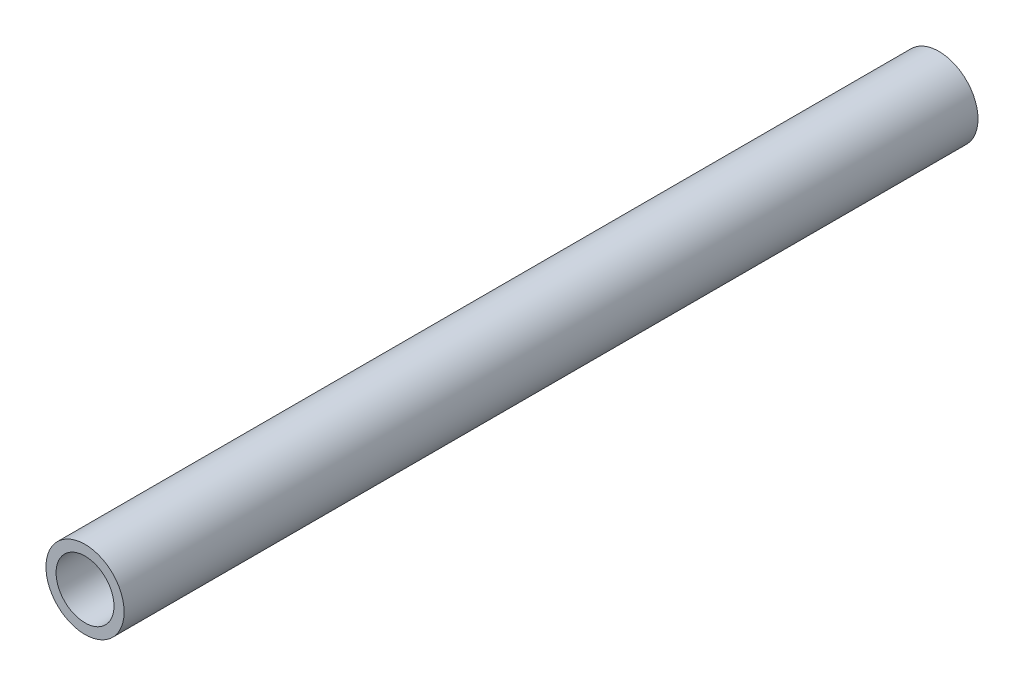
ISO-10303-21;
HEADER;
FILE_DESCRIPTION(('STEP AP214'),'2;1');
FILE_NAME('part.step','',(''),(''),'','','');
FILE_SCHEMA(('AUTOMOTIVE_DESIGN { 1 0 10303 214 1 1 1 1 }'));
ENDSEC;
DATA;
#1=APPLICATION_CONTEXT('core data for automotive mechanical design processes');
#2=APPLICATION_PROTOCOL_DEFINITION('international standard','automotive_design',2000,#1);
#3=PRODUCT_CONTEXT('',#1,'mechanical');
#4=PRODUCT('Part','Part','',(#3));
#5=PRODUCT_RELATED_PRODUCT_CATEGORY('part','',(#4));
#6=PRODUCT_DEFINITION_FORMATION('','',#4);
#7=PRODUCT_DEFINITION_CONTEXT('part definition',#1,'design');
#8=PRODUCT_DEFINITION('design','',#6,#7);
#9=PRODUCT_DEFINITION_SHAPE('','',#8);
#10=(LENGTH_UNIT() NAMED_UNIT(*) SI_UNIT(.MILLI.,.METRE.));
#11=(NAMED_UNIT(*) PLANE_ANGLE_UNIT() SI_UNIT($,.RADIAN.));
#12=(NAMED_UNIT(*) SI_UNIT($,.STERADIAN.) SOLID_ANGLE_UNIT());
#13=UNCERTAINTY_MEASURE_WITH_UNIT(LENGTH_MEASURE(1.E-05),#10,'distance_accuracy_value','');
#14=(GEOMETRIC_REPRESENTATION_CONTEXT(3) GLOBAL_UNCERTAINTY_ASSIGNED_CONTEXT((#13)) GLOBAL_UNIT_ASSIGNED_CONTEXT((#10,
#11,#12)) REPRESENTATION_CONTEXT('',''));
#15=CARTESIAN_POINT('',(0.,0.,0.));
#16=DIRECTION('',(0.,0.,1.));
#17=DIRECTION('',(1.,0.,0.));
#18=AXIS2_PLACEMENT_3D('',#15,#16,#17);
#19=CARTESIAN_POINT('',(0.,0.,-91.5));
#20=DIRECTION('',(0.,0.,1.));
#21=DIRECTION('',(1.,0.,0.));
#22=AXIS2_PLACEMENT_3D('',#19,#20,#21);
#23=CYLINDRICAL_SURFACE('',#22,10.668);
#24=CARTESIAN_POINT('',(0.,0.,-91.5));
#25=DIRECTION('',(0.,0.,1.));
#26=DIRECTION('',(1.,0.,0.));
#27=AXIS2_PLACEMENT_3D('',#24,#25,#26);
#28=CIRCLE('',#27,10.668);
#29=CARTESIAN_POINT('',(10.668,0.,-91.5));
#30=VERTEX_POINT('',#29);
#31=EDGE_CURVE('E11',#30,#30,#28,.T.);
#32=ORIENTED_EDGE('',*,*,#31,.T.);
#33=EDGE_LOOP('',(#32));
#34=FACE_BOUND('',#33,.T.);
#35=CARTESIAN_POINT('',(0.,0.,141.5));
#36=DIRECTION('',(0.,0.,1.));
#37=DIRECTION('',(1.,0.,0.));
#38=AXIS2_PLACEMENT_3D('',#35,#36,#37);
#39=CIRCLE('',#38,10.668);
#40=CARTESIAN_POINT('',(10.668,0.,141.5));
#41=VERTEX_POINT('',#40);
#42=EDGE_CURVE('E53',#41,#41,#39,.T.);
#43=ORIENTED_EDGE('',*,*,#42,.F.);
#44=EDGE_LOOP('',(#43));
#45=FACE_BOUND('',#44,.T.);
#46=ADVANCED_FACE('F43',(#34,#45),#23,.T.);
#47=CARTESIAN_POINT('',(0.,0.,-91.5));
#48=DIRECTION('',(0.,0.,1.));
#49=DIRECTION('',(1.,0.,0.));
#50=AXIS2_PLACEMENT_3D('',#47,#48,#49);
#51=PLANE('',#50);
#52=CARTESIAN_POINT('',(0.,0.,-91.5));
#53=DIRECTION('',(0.,0.,1.));
#54=DIRECTION('',(1.,0.,0.));
#55=AXIS2_PLACEMENT_3D('',#52,#53,#54);
#56=CIRCLE('',#55,7.8994);
#57=CARTESIAN_POINT('',(7.8994,0.,-91.5));
#58=VERTEX_POINT('',#57);
#59=EDGE_CURVE('E49',#58,#58,#56,.T.);
#60=ORIENTED_EDGE('',*,*,#59,.T.);
#61=EDGE_LOOP('',(#60));
#62=FACE_BOUND('',#61,.T.);
#63=ORIENTED_EDGE('',*,*,#31,.F.);
#64=EDGE_LOOP('',(#63));
#65=FACE_BOUND('',#64,.T.);
#66=ADVANCED_FACE('F72',(#62,#65),#51,.F.);
#67=CARTESIAN_POINT('',(0.,0.,-91.5));
#68=DIRECTION('',(0.,0.,1.));
#69=DIRECTION('',(1.,0.,0.));
#70=AXIS2_PLACEMENT_3D('',#67,#68,#69);
#71=CYLINDRICAL_SURFACE('',#70,7.8994);
#72=ORIENTED_EDGE('',*,*,#59,.F.);
#73=EDGE_LOOP('',(#72));
#74=FACE_BOUND('',#73,.T.);
#75=CARTESIAN_POINT('',(0.,0.,141.5));
#76=DIRECTION('',(0.,0.,1.));
#77=DIRECTION('',(1.,0.,0.));
#78=AXIS2_PLACEMENT_3D('',#75,#76,#77);
#79=CIRCLE('',#78,7.8994);
#80=CARTESIAN_POINT('',(7.8994,0.,141.5));
#81=VERTEX_POINT('',#80);
#82=EDGE_CURVE('E57',#81,#81,#79,.T.);
#83=ORIENTED_EDGE('',*,*,#82,.T.);
#84=EDGE_LOOP('',(#83));
#85=FACE_BOUND('',#84,.T.);
#86=ADVANCED_FACE('F63',(#74,#85),#71,.F.);
#87=CARTESIAN_POINT('',(0.,0.,141.5));
#88=DIRECTION('',(0.,0.,1.));
#89=DIRECTION('',(1.,0.,0.));
#90=AXIS2_PLACEMENT_3D('',#87,#88,#89);
#91=PLANE('',#90);
#92=ORIENTED_EDGE('',*,*,#42,.T.);
#93=EDGE_LOOP('',(#92));
#94=FACE_BOUND('',#93,.T.);
#95=ORIENTED_EDGE('',*,*,#82,.F.);
#96=EDGE_LOOP('',(#95));
#97=FACE_BOUND('',#96,.T.);
#98=ADVANCED_FACE('F65',(#94,#97),#91,.T.);
#99=CLOSED_SHELL('',(#46,#66,#86,#98));
#100=MANIFOLD_SOLID_BREP('B2',#99);
#101=ADVANCED_BREP_SHAPE_REPRESENTATION('',(#18,#100),#14);
#102=SHAPE_DEFINITION_REPRESENTATION(#9,#101);
ENDSEC;
END-ISO-10303-21;
